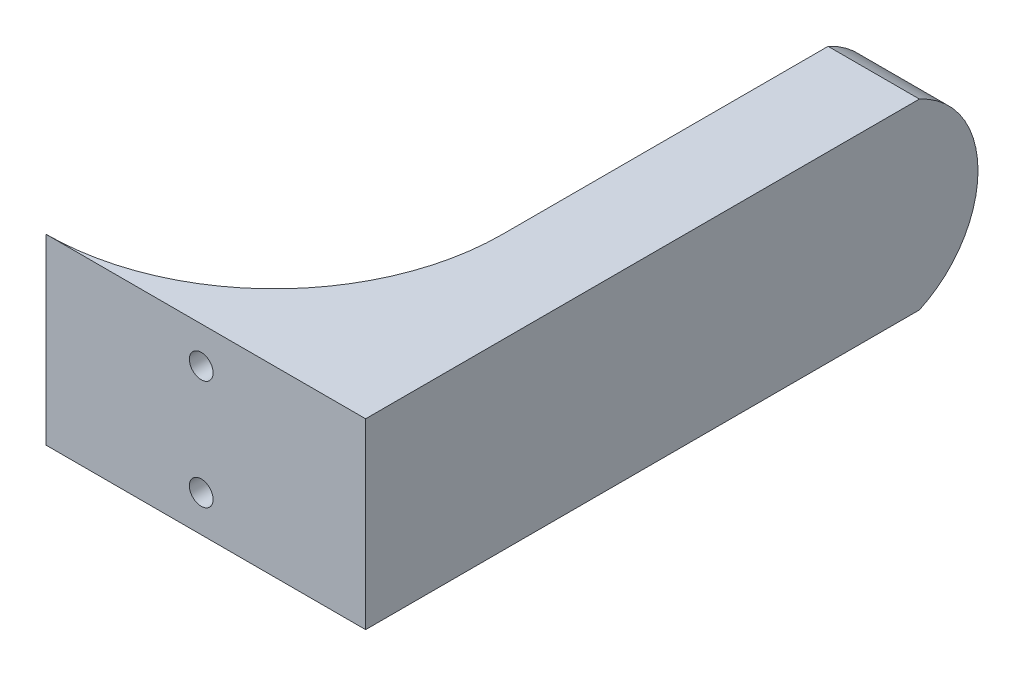
ISO-10303-21;
HEADER;
FILE_DESCRIPTION(('STEP AP214'),'2;1');
FILE_NAME('part.step','',(''),(''),'','','');
FILE_SCHEMA(('AUTOMOTIVE_DESIGN { 1 0 10303 214 1 1 1 1 }'));
ENDSEC;
DATA;
#1=APPLICATION_CONTEXT('core data for automotive mechanical design processes');
#2=APPLICATION_PROTOCOL_DEFINITION('international standard','automotive_design',2000,#1);
#3=PRODUCT_CONTEXT('',#1,'mechanical');
#4=PRODUCT('Part','Part','',(#3));
#5=PRODUCT_RELATED_PRODUCT_CATEGORY('part','',(#4));
#6=PRODUCT_DEFINITION_FORMATION('','',#4);
#7=PRODUCT_DEFINITION_CONTEXT('part definition',#1,'design');
#8=PRODUCT_DEFINITION('design','',#6,#7);
#9=PRODUCT_DEFINITION_SHAPE('','',#8);
#10=(LENGTH_UNIT() NAMED_UNIT(*) SI_UNIT(.MILLI.,.METRE.));
#11=(NAMED_UNIT(*) PLANE_ANGLE_UNIT() SI_UNIT($,.RADIAN.));
#12=(NAMED_UNIT(*) SI_UNIT($,.STERADIAN.) SOLID_ANGLE_UNIT());
#13=UNCERTAINTY_MEASURE_WITH_UNIT(LENGTH_MEASURE(1.E-05),#10,'distance_accuracy_value','');
#14=(GEOMETRIC_REPRESENTATION_CONTEXT(3) GLOBAL_UNCERTAINTY_ASSIGNED_CONTEXT((#13)) GLOBAL_UNIT_ASSIGNED_CONTEXT((#10,
#11,#12)) REPRESENTATION_CONTEXT('',''));
#15=CARTESIAN_POINT('',(0.,0.,0.));
#16=DIRECTION('',(0.,0.,1.));
#17=DIRECTION('',(1.,0.,0.));
#18=AXIS2_PLACEMENT_3D('',#15,#16,#17);
#19=CARTESIAN_POINT('',(89.7902216057907,2.2225,6.2762225952467));
#20=DIRECTION('',(0.86602540378444,0.499999999999998,0.));
#21=DIRECTION('',(-0.499999999999998,0.86602540378444,0.));
#22=AXIS2_PLACEMENT_3D('',#19,#20,#21);
#23=PLANE('',#22);
#24=DIRECTION('',(0.,0.,1.));
#25=VECTOR('',#24,1.);
#26=CARTESIAN_POINT('',(88.1404432115813,5.08000000000001,6.2762225952467));
#27=LINE('',#26,#25);
#28=CARTESIAN_POINT('',(88.1404432115813,5.08000000000001,85.6423060078275));
#29=VERTEX_POINT('',#28);
#30=CARTESIAN_POINT('',(88.1404432115813,5.08000000000001,88.9));
#31=VERTEX_POINT('',#30);
#32=EDGE_CURVE('E161',#29,#31,#27,.T.);
#33=ORIENTED_EDGE('',*,*,#32,.T.);
#34=DIRECTION('',(0.499999999999998,-0.86602540378444,0.));
#35=VECTOR('',#34,1.);
#36=CARTESIAN_POINT('',(89.7902216057907,2.2225,88.9));
#37=LINE('',#36,#35);
#38=CARTESIAN_POINT('',(89.7902216057907,2.2225,88.9));
#39=VERTEX_POINT('',#38);
#40=EDGE_CURVE('E150',#31,#39,#37,.T.);
#41=ORIENTED_EDGE('',*,*,#40,.T.);
#42=DIRECTION('',(0.,0.,1.));
#43=VECTOR('',#42,1.);
#44=CARTESIAN_POINT('',(89.7902216057907,2.2225,6.2762225952467));
#45=LINE('',#44,#43);
#46=CARTESIAN_POINT('',(89.7902216057907,2.2225,84.3972876356746));
#47=VERTEX_POINT('',#46);
#48=EDGE_CURVE('E158',#47,#39,#45,.T.);
#49=ORIENTED_EDGE('',*,*,#48,.F.);
#50=CARTESIAN_POINT('',(69.85,36.7599769354123,59.69));
#51=DIRECTION('',(0.86602540378444,0.499999999999998,0.));
#52=DIRECTION('',(0.499999999999998,-0.86602540378444,0.));
#53=AXIS2_PLACEMENT_3D('',#50,#51,#52);
#54=ELLIPSE('',#53,63.5000000000002,31.75);
#55=EDGE_CURVE('E244',#47,#29,#54,.F.);
#56=ORIENTED_EDGE('',*,*,#55,.T.);
#57=EDGE_LOOP('',(#33,#41,#49,#56));
#58=FACE_BOUND('',#57,.T.);
#59=ADVANCED_FACE('F33',(#58),#23,.T.);
#60=CARTESIAN_POINT('',(88.1404432115813,5.08000000000001,6.2762225952467));
#61=DIRECTION('',(0.86602540378444,-0.499999999999998,0.));
#62=DIRECTION('',(0.499999999999998,0.86602540378444,0.));
#63=AXIS2_PLACEMENT_3D('',#60,#61,#62);
#64=PLANE('',#63);
#65=DIRECTION('',(0.,0.,1.));
#66=VECTOR('',#65,1.);
#67=CARTESIAN_POINT('',(89.7902216057907,7.93749999999999,6.2762225952467));
#68=LINE('',#67,#66);
#69=CARTESIAN_POINT('',(89.7902216057907,7.93749999999999,84.3972876356746));
#70=VERTEX_POINT('',#69);
#71=CARTESIAN_POINT('',(89.7902216057907,7.93749999999999,88.9));
#72=VERTEX_POINT('',#71);
#73=EDGE_CURVE('E183',#70,#72,#68,.T.);
#74=ORIENTED_EDGE('',*,*,#73,.T.);
#75=DIRECTION('',(-0.499999999999998,-0.86602540378444,0.));
#76=VECTOR('',#75,1.);
#77=CARTESIAN_POINT('',(88.1404432115813,5.08000000000001,88.9));
#78=LINE('',#77,#76);
#79=EDGE_CURVE('E162',#72,#31,#78,.T.);
#80=ORIENTED_EDGE('',*,*,#79,.T.);
#81=ORIENTED_EDGE('',*,*,#32,.F.);
#82=CARTESIAN_POINT('',(69.85,-26.5999769354123,59.69));
#83=DIRECTION('',(0.86602540378444,-0.499999999999998,0.));
#84=DIRECTION('',(-0.499999999999998,-0.86602540378444,0.));
#85=AXIS2_PLACEMENT_3D('',#82,#83,#84);
#86=ELLIPSE('',#85,63.5000000000002,31.75);
#87=EDGE_CURVE('E242',#29,#70,#86,.F.);
#88=ORIENTED_EDGE('',*,*,#87,.T.);
#89=EDGE_LOOP('',(#74,#80,#81,#88));
#90=FACE_BOUND('',#89,.T.);
#91=ADVANCED_FACE('F378',(#90),#64,.T.);
#92=CARTESIAN_POINT('',(89.7902216057907,7.93749999999999,6.2762225952467));
#93=DIRECTION('',(0.,-1.,0.));
#94=DIRECTION('',(0.,0.,-1.));
#95=AXIS2_PLACEMENT_3D('',#92,#93,#94);
#96=PLANE('',#95);
#97=DIRECTION('',(0.,0.,1.));
#98=VECTOR('',#97,1.);
#99=CARTESIAN_POINT('',(93.0897783942094,7.93749999999999,6.2762225952467));
#100=LINE('',#99,#98);
#101=CARTESIAN_POINT('',(93.0897783942094,7.93749999999999,81.3227344593336));
#102=VERTEX_POINT('',#101);
#103=CARTESIAN_POINT('',(93.0897783942094,7.93749999999999,88.9));
#104=VERTEX_POINT('',#103);
#105=EDGE_CURVE('E180',#102,#104,#100,.T.);
#106=ORIENTED_EDGE('',*,*,#105,.T.);
#107=DIRECTION('',(-1.,0.,0.));
#108=VECTOR('',#107,1.);
#109=CARTESIAN_POINT('',(89.7902216057907,7.93749999999999,88.9));
#110=LINE('',#109,#108);
#111=EDGE_CURVE('E311',#104,#72,#110,.T.);
#112=ORIENTED_EDGE('',*,*,#111,.T.);
#113=ORIENTED_EDGE('',*,*,#73,.F.);
#114=CARTESIAN_POINT('',(69.85,7.93749999999999,59.69));
#115=DIRECTION('',(0.,-1.,0.));
#116=DIRECTION('',(0.,0.,-1.));
#117=AXIS2_PLACEMENT_3D('',#114,#115,#116);
#118=CIRCLE('',#117,31.75);
#119=EDGE_CURVE('E240',#70,#102,#118,.F.);
#120=ORIENTED_EDGE('',*,*,#119,.T.);
#121=EDGE_LOOP('',(#106,#112,#113,#120));
#122=FACE_BOUND('',#121,.T.);
#123=ADVANCED_FACE('F383',(#122),#96,.T.);
#124=CARTESIAN_POINT('',(93.0897783942094,7.93749999999999,6.2762225952467));
#125=DIRECTION('',(-0.866025403784439,-0.499999999999999,0.));
#126=DIRECTION('',(0.499999999999999,-0.866025403784439,0.));
#127=AXIS2_PLACEMENT_3D('',#124,#125,#126);
#128=PLANE('',#127);
#129=DIRECTION('',(0.,0.,1.));
#130=VECTOR('',#129,1.);
#131=CARTESIAN_POINT('',(94.7395567884187,5.07999999999999,6.2762225952467));
#132=LINE('',#131,#130);
#133=CARTESIAN_POINT('',(94.7395567884187,5.07999999999999,79.4022414472855));
#134=VERTEX_POINT('',#133);
#135=CARTESIAN_POINT('',(94.7395567884187,5.07999999999999,88.9));
#136=VERTEX_POINT('',#135);
#137=EDGE_CURVE('E170',#134,#136,#132,.T.);
#138=ORIENTED_EDGE('',*,*,#137,.T.);
#139=DIRECTION('',(-0.499999999999999,0.866025403784439,0.));
#140=VECTOR('',#139,1.);
#141=CARTESIAN_POINT('',(93.0897783942094,7.93749999999999,88.9));
#142=LINE('',#141,#140);
#143=EDGE_CURVE('E314',#136,#104,#142,.T.);
#144=ORIENTED_EDGE('',*,*,#143,.T.);
#145=ORIENTED_EDGE('',*,*,#105,.F.);
#146=CARTESIAN_POINT('',(69.85,48.1899769354122,59.69));
#147=DIRECTION('',(-0.866025403784439,-0.499999999999999,0.));
#148=DIRECTION('',(0.499999999999999,-0.866025403784439,0.));
#149=AXIS2_PLACEMENT_3D('',#146,#147,#148);
#150=ELLIPSE('',#149,63.5000000000001,31.75);
#151=EDGE_CURVE('E238',#102,#134,#150,.F.);
#152=ORIENTED_EDGE('',*,*,#151,.T.);
#153=EDGE_LOOP('',(#138,#144,#145,#152));
#154=FACE_BOUND('',#153,.T.);
#155=ADVANCED_FACE('F486',(#154),#128,.T.);
#156=CARTESIAN_POINT('',(94.7395567884187,5.07999999999999,6.2762225952467));
#157=DIRECTION('',(-0.86602540378444,0.499999999999997,0.));
#158=DIRECTION('',(-0.499999999999997,-0.86602540378444,0.));
#159=AXIS2_PLACEMENT_3D('',#156,#157,#158);
#160=PLANE('',#159);
#161=DIRECTION('',(0.,0.,1.));
#162=VECTOR('',#161,1.);
#163=CARTESIAN_POINT('',(93.0897783942094,2.2225,6.2762225952467));
#164=LINE('',#163,#162);
#165=CARTESIAN_POINT('',(93.0897783942094,2.2225,81.3227344593336));
#166=VERTEX_POINT('',#165);
#167=CARTESIAN_POINT('',(93.0897783942094,2.2225,88.9));
#168=VERTEX_POINT('',#167);
#169=EDGE_CURVE('E167',#166,#168,#164,.T.);
#170=ORIENTED_EDGE('',*,*,#169,.T.);
#171=DIRECTION('',(0.499999999999997,0.86602540378444,0.));
#172=VECTOR('',#171,1.);
#173=CARTESIAN_POINT('',(94.7395567884187,5.07999999999999,88.9));
#174=LINE('',#173,#172);
#175=EDGE_CURVE('E48',#168,#136,#174,.T.);
#176=ORIENTED_EDGE('',*,*,#175,.T.);
#177=ORIENTED_EDGE('',*,*,#137,.F.);
#178=CARTESIAN_POINT('',(69.85,-38.0299769354124,59.69));
#179=DIRECTION('',(-0.86602540378444,0.499999999999997,0.));
#180=DIRECTION('',(-0.499999999999997,-0.86602540378444,0.));
#181=AXIS2_PLACEMENT_3D('',#178,#179,#180);
#182=ELLIPSE('',#181,63.5000000000003,31.75);
#183=EDGE_CURVE('E235',#134,#166,#182,.F.);
#184=ORIENTED_EDGE('',*,*,#183,.T.);
#185=EDGE_LOOP('',(#170,#176,#177,#184));
#186=FACE_BOUND('',#185,.T.);
#187=ADVANCED_FACE('F494',(#186),#160,.T.);
#188=CARTESIAN_POINT('',(93.0897783942094,2.2225,6.2762225952467));
#189=DIRECTION('',(0.,1.,0.));
#190=DIRECTION('',(0.,0.,1.));
#191=AXIS2_PLACEMENT_3D('',#188,#189,#190);
#192=PLANE('',#191);
#193=ORIENTED_EDGE('',*,*,#48,.T.);
#194=DIRECTION('',(1.,0.,0.));
#195=VECTOR('',#194,1.);
#196=CARTESIAN_POINT('',(93.0897783942094,2.2225,88.9));
#197=LINE('',#196,#195);
#198=EDGE_CURVE('E11',#39,#168,#197,.T.);
#199=ORIENTED_EDGE('',*,*,#198,.T.);
#200=ORIENTED_EDGE('',*,*,#169,.F.);
#201=CARTESIAN_POINT('',(69.85,2.2225,59.69));
#202=DIRECTION('',(0.,1.,0.));
#203=DIRECTION('',(0.,0.,1.));
#204=AXIS2_PLACEMENT_3D('',#201,#202,#203);
#205=CIRCLE('',#204,31.75);
#206=EDGE_CURVE('E166',#166,#47,#205,.F.);
#207=ORIENTED_EDGE('',*,*,#206,.T.);
#208=EDGE_LOOP('',(#193,#199,#200,#207));
#209=FACE_BOUND('',#208,.T.);
#210=ADVANCED_FACE('F164',(#209),#192,.T.);
#211=CARTESIAN_POINT('',(89.7902216057907,17.4625,6.2762225952467));
#212=DIRECTION('',(0.86602540378444,0.499999999999998,0.));
#213=DIRECTION('',(-0.499999999999998,0.86602540378444,0.));
#214=AXIS2_PLACEMENT_3D('',#211,#212,#213);
#215=PLANE('',#214);
#216=DIRECTION('',(0.,0.,1.));
#217=VECTOR('',#216,1.);
#218=CARTESIAN_POINT('',(88.1404432115813,20.32,6.2762225952467));
#219=LINE('',#218,#217);
#220=CARTESIAN_POINT('',(88.1404432115813,20.32,85.6423060078275));
#221=VERTEX_POINT('',#220);
#222=CARTESIAN_POINT('',(88.1404432115813,20.32,88.9));
#223=VERTEX_POINT('',#222);
#224=EDGE_CURVE('E175',#221,#223,#219,.T.);
#225=ORIENTED_EDGE('',*,*,#224,.T.);
#226=DIRECTION('',(0.499999999999998,-0.86602540378444,0.));
#227=VECTOR('',#226,1.);
#228=CARTESIAN_POINT('',(89.7902216057907,17.4625,88.9));
#229=LINE('',#228,#227);
#230=CARTESIAN_POINT('',(89.7902216057907,17.4625,88.9));
#231=VERTEX_POINT('',#230);
#232=EDGE_CURVE('E172',#223,#231,#229,.T.);
#233=ORIENTED_EDGE('',*,*,#232,.T.);
#234=DIRECTION('',(0.,0.,1.));
#235=VECTOR('',#234,1.);
#236=CARTESIAN_POINT('',(89.7902216057907,17.4625,6.2762225952467));
#237=LINE('',#236,#235);
#238=CARTESIAN_POINT('',(89.7902216057907,17.4625,84.3972876356746));
#239=VERTEX_POINT('',#238);
#240=EDGE_CURVE('E187',#239,#231,#237,.T.);
#241=ORIENTED_EDGE('',*,*,#240,.F.);
#242=CARTESIAN_POINT('',(69.85,51.9999769354123,59.69));
#243=DIRECTION('',(0.86602540378444,0.499999999999998,0.));
#244=DIRECTION('',(0.499999999999998,-0.86602540378444,0.));
#245=AXIS2_PLACEMENT_3D('',#242,#243,#244);
#246=ELLIPSE('',#245,63.5000000000003,31.75);
#247=EDGE_CURVE('E257',#239,#221,#246,.F.);
#248=ORIENTED_EDGE('',*,*,#247,.T.);
#249=EDGE_LOOP('',(#225,#233,#241,#248));
#250=FACE_BOUND('',#249,.T.);
#251=ADVANCED_FACE('F286',(#250),#215,.T.);
#252=CARTESIAN_POINT('',(88.1404432115813,20.32,6.2762225952467));
#253=DIRECTION('',(0.86602540378444,-0.499999999999999,0.));
#254=DIRECTION('',(0.499999999999999,0.86602540378444,0.));
#255=AXIS2_PLACEMENT_3D('',#252,#253,#254);
#256=PLANE('',#255);
#257=DIRECTION('',(0.,0.,1.));
#258=VECTOR('',#257,1.);
#259=CARTESIAN_POINT('',(89.7902216057907,23.1775,6.2762225952467));
#260=LINE('',#259,#258);
#261=CARTESIAN_POINT('',(89.7902216057907,23.1775,84.3972876356746));
#262=VERTEX_POINT('',#261);
#263=CARTESIAN_POINT('',(89.7902216057907,23.1775,88.9));
#264=VERTEX_POINT('',#263);
#265=EDGE_CURVE('E278',#262,#264,#260,.T.);
#266=ORIENTED_EDGE('',*,*,#265,.T.);
#267=DIRECTION('',(-0.499999999999999,-0.86602540378444,0.));
#268=VECTOR('',#267,1.);
#269=CARTESIAN_POINT('',(88.1404432115813,20.32,88.9));
#270=LINE('',#269,#268);
#271=EDGE_CURVE('E290',#264,#223,#270,.T.);
#272=ORIENTED_EDGE('',*,*,#271,.T.);
#273=ORIENTED_EDGE('',*,*,#224,.F.);
#274=CARTESIAN_POINT('',(69.85,-11.3599769354122,59.69));
#275=DIRECTION('',(0.86602540378444,-0.499999999999999,0.));
#276=DIRECTION('',(-0.499999999999999,-0.86602540378444,0.));
#277=AXIS2_PLACEMENT_3D('',#274,#275,#276);
#278=ELLIPSE('',#277,63.5000000000002,31.75);
#279=EDGE_CURVE('E255',#221,#262,#278,.F.);
#280=ORIENTED_EDGE('',*,*,#279,.T.);
#281=EDGE_LOOP('',(#266,#272,#273,#280));
#282=FACE_BOUND('',#281,.T.);
#283=ADVANCED_FACE('F289',(#282),#256,.T.);
#284=CARTESIAN_POINT('',(89.7902216057907,23.1775,6.2762225952467));
#285=DIRECTION('',(0.,-1.,0.));
#286=DIRECTION('',(0.,0.,-1.));
#287=AXIS2_PLACEMENT_3D('',#284,#285,#286);
#288=PLANE('',#287);
#289=DIRECTION('',(0.,0.,1.));
#290=VECTOR('',#289,1.);
#291=CARTESIAN_POINT('',(93.0897783942094,23.1775,6.2762225952467));
#292=LINE('',#291,#290);
#293=CARTESIAN_POINT('',(93.0897783942094,23.1775,81.3227344593336));
#294=VERTEX_POINT('',#293);
#295=CARTESIAN_POINT('',(93.0897783942094,23.1775,88.9));
#296=VERTEX_POINT('',#295);
#297=EDGE_CURVE('E273',#294,#296,#292,.T.);
#298=ORIENTED_EDGE('',*,*,#297,.T.);
#299=DIRECTION('',(-1.,0.,0.));
#300=VECTOR('',#299,1.);
#301=CARTESIAN_POINT('',(89.7902216057907,23.1775,88.9));
#302=LINE('',#301,#300);
#303=EDGE_CURVE('E303',#296,#264,#302,.T.);
#304=ORIENTED_EDGE('',*,*,#303,.T.);
#305=ORIENTED_EDGE('',*,*,#265,.F.);
#306=CARTESIAN_POINT('',(69.85,23.1775,59.69));
#307=DIRECTION('',(0.,-1.,0.));
#308=DIRECTION('',(0.,0.,-1.));
#309=AXIS2_PLACEMENT_3D('',#306,#307,#308);
#310=CIRCLE('',#309,31.75);
#311=EDGE_CURVE('E253',#262,#294,#310,.F.);
#312=ORIENTED_EDGE('',*,*,#311,.T.);
#313=EDGE_LOOP('',(#298,#304,#305,#312));
#314=FACE_BOUND('',#313,.T.);
#315=ADVANCED_FACE('F297',(#314),#288,.T.);
#316=CARTESIAN_POINT('',(93.0897783942094,23.1775,6.2762225952467));
#317=DIRECTION('',(-0.866025403784436,-0.500000000000005,0.));
#318=DIRECTION('',(0.500000000000005,-0.866025403784436,0.));
#319=AXIS2_PLACEMENT_3D('',#316,#317,#318);
#320=PLANE('',#319);
#321=DIRECTION('',(0.,0.,1.));
#322=VECTOR('',#321,1.);
#323=CARTESIAN_POINT('',(94.7395567884188,20.32,6.2762225952467));
#324=LINE('',#323,#322);
#325=CARTESIAN_POINT('',(94.7395567884188,20.32,79.4022414472855));
#326=VERTEX_POINT('',#325);
#327=CARTESIAN_POINT('',(94.7395567884188,20.32,88.9));
#328=VERTEX_POINT('',#327);
#329=EDGE_CURVE('E271',#326,#328,#324,.T.);
#330=ORIENTED_EDGE('',*,*,#329,.T.);
#331=DIRECTION('',(-0.500000000000005,0.866025403784436,0.));
#332=VECTOR('',#331,1.);
#333=CARTESIAN_POINT('',(93.0897783942094,23.1775,88.9));
#334=LINE('',#333,#332);
#335=EDGE_CURVE('E302',#328,#296,#334,.T.);
#336=ORIENTED_EDGE('',*,*,#335,.T.);
#337=ORIENTED_EDGE('',*,*,#297,.F.);
#338=CARTESIAN_POINT('',(69.85,63.4299769354115,59.69));
#339=DIRECTION('',(-0.866025403784436,-0.500000000000005,0.));
#340=DIRECTION('',(0.500000000000005,-0.866025403784436,0.));
#341=AXIS2_PLACEMENT_3D('',#338,#339,#340);
#342=ELLIPSE('',#341,63.4999999999993,31.75);
#343=EDGE_CURVE('E251',#294,#326,#342,.F.);
#344=ORIENTED_EDGE('',*,*,#343,.T.);
#345=EDGE_LOOP('',(#330,#336,#337,#344));
#346=FACE_BOUND('',#345,.T.);
#347=ADVANCED_FACE('F301',(#346),#320,.T.);
#348=CARTESIAN_POINT('',(94.7395567884188,20.32,6.2762225952467));
#349=DIRECTION('',(-0.866025403784436,0.500000000000004,0.));
#350=DIRECTION('',(-0.500000000000004,-0.866025403784436,0.));
#351=AXIS2_PLACEMENT_3D('',#348,#349,#350);
#352=PLANE('',#351);
#353=DIRECTION('',(0.,0.,1.));
#354=VECTOR('',#353,1.);
#355=CARTESIAN_POINT('',(93.0897783942094,17.4625,6.2762225952467));
#356=LINE('',#355,#354);
#357=CARTESIAN_POINT('',(93.0897783942094,17.4625,81.3227344593336));
#358=VERTEX_POINT('',#357);
#359=CARTESIAN_POINT('',(93.0897783942094,17.4625,88.9));
#360=VERTEX_POINT('',#359);
#361=EDGE_CURVE('E262',#358,#360,#356,.T.);
#362=ORIENTED_EDGE('',*,*,#361,.T.);
#363=DIRECTION('',(0.500000000000004,0.866025403784436,0.));
#364=VECTOR('',#363,1.);
#365=CARTESIAN_POINT('',(94.7395567884188,20.32,88.9));
#366=LINE('',#365,#364);
#367=EDGE_CURVE('E55',#360,#328,#366,.T.);
#368=ORIENTED_EDGE('',*,*,#367,.T.);
#369=ORIENTED_EDGE('',*,*,#329,.F.);
#370=CARTESIAN_POINT('',(69.85,-22.7899769354117,59.69));
#371=DIRECTION('',(-0.866025403784436,0.500000000000004,0.));
#372=DIRECTION('',(-0.500000000000004,-0.866025403784436,0.));
#373=AXIS2_PLACEMENT_3D('',#370,#371,#372);
#374=ELLIPSE('',#373,63.4999999999995,31.75);
#375=EDGE_CURVE('E248',#326,#358,#374,.F.);
#376=ORIENTED_EDGE('',*,*,#375,.T.);
#377=EDGE_LOOP('',(#362,#368,#369,#376));
#378=FACE_BOUND('',#377,.T.);
#379=ADVANCED_FACE('F266',(#378),#352,.T.);
#380=CARTESIAN_POINT('',(93.0897783942094,17.4625,6.2762225952467));
#381=DIRECTION('',(0.,1.,0.));
#382=DIRECTION('',(0.,0.,1.));
#383=AXIS2_PLACEMENT_3D('',#380,#381,#382);
#384=PLANE('',#383);
#385=ORIENTED_EDGE('',*,*,#240,.T.);
#386=DIRECTION('',(1.,0.,0.));
#387=VECTOR('',#386,1.);
#388=CARTESIAN_POINT('',(93.0897783942094,17.4625,88.9));
#389=LINE('',#388,#387);
#390=EDGE_CURVE('E41',#231,#360,#389,.T.);
#391=ORIENTED_EDGE('',*,*,#390,.T.);
#392=ORIENTED_EDGE('',*,*,#361,.F.);
#393=CARTESIAN_POINT('',(69.85,17.4625,59.69));
#394=DIRECTION('',(0.,1.,0.));
#395=DIRECTION('',(0.,0.,1.));
#396=AXIS2_PLACEMENT_3D('',#393,#394,#395);
#397=CIRCLE('',#396,31.75);
#398=EDGE_CURVE('E246',#358,#239,#397,.F.);
#399=ORIENTED_EDGE('',*,*,#398,.T.);
#400=EDGE_LOOP('',(#385,#391,#392,#399));
#401=FACE_BOUND('',#400,.T.);
#402=ADVANCED_FACE('F261',(#401),#384,.T.);
#403=CARTESIAN_POINT('',(69.85,25.4,59.69));
#404=DIRECTION('',(0.,-1.,0.));
#405=DIRECTION('',(0.,0.,-1.));
#406=AXIS2_PLACEMENT_3D('',#403,#404,#405);
#407=CYLINDRICAL_SURFACE('',#406,31.75);
#408=ORIENTED_EDGE('',*,*,#55,.F.);
#409=ORIENTED_EDGE('',*,*,#206,.F.);
#410=ORIENTED_EDGE('',*,*,#183,.F.);
#411=ORIENTED_EDGE('',*,*,#151,.F.);
#412=ORIENTED_EDGE('',*,*,#119,.F.);
#413=ORIENTED_EDGE('',*,*,#87,.F.);
#414=EDGE_LOOP('',(#408,#409,#410,#411,#412,#413));
#415=FACE_BOUND('',#414,.T.);
#416=CARTESIAN_POINT('',(69.85,0.,59.69));
#417=DIRECTION('',(0.,-1.,0.));
#418=DIRECTION('',(0.,0.,1.));
#419=AXIS2_PLACEMENT_3D('',#416,#417,#418);
#420=CIRCLE('',#419,31.75);
#421=CARTESIAN_POINT('',(101.6,0.,59.69));
#422=VERTEX_POINT('',#421);
#423=CARTESIAN_POINT('',(69.85,0.,91.44));
#424=VERTEX_POINT('',#423);
#425=EDGE_CURVE('E219',#422,#424,#420,.T.);
#426=ORIENTED_EDGE('',*,*,#425,.T.);
#427=DIRECTION('',(0.,-1.,0.));
#428=VECTOR('',#427,1.);
#429=CARTESIAN_POINT('',(69.85,25.4,91.44));
#430=LINE('',#429,#428);
#431=CARTESIAN_POINT('',(69.85,25.4,91.44));
#432=VERTEX_POINT('',#431);
#433=EDGE_CURVE('E224',#432,#424,#430,.T.);
#434=ORIENTED_EDGE('',*,*,#433,.F.);
#435=CARTESIAN_POINT('',(69.85,25.4,59.69));
#436=DIRECTION('',(0.,-1.,0.));
#437=DIRECTION('',(0.,0.,1.));
#438=AXIS2_PLACEMENT_3D('',#435,#436,#437);
#439=CIRCLE('',#438,31.75);
#440=CARTESIAN_POINT('',(101.6,25.4,59.69));
#441=VERTEX_POINT('',#440);
#442=EDGE_CURVE('E221',#441,#432,#439,.T.);
#443=ORIENTED_EDGE('',*,*,#442,.F.);
#444=DIRECTION('',(0.,-1.,0.));
#445=VECTOR('',#444,1.);
#446=CARTESIAN_POINT('',(101.6,25.4,59.69));
#447=LINE('',#446,#445);
#448=EDGE_CURVE('E206',#441,#422,#447,.T.);
#449=ORIENTED_EDGE('',*,*,#448,.T.);
#450=EDGE_LOOP('',(#426,#434,#443,#449));
#451=FACE_BOUND('',#450,.T.);
#452=ORIENTED_EDGE('',*,*,#247,.F.);
#453=ORIENTED_EDGE('',*,*,#398,.F.);
#454=ORIENTED_EDGE('',*,*,#375,.F.);
#455=ORIENTED_EDGE('',*,*,#343,.F.);
#456=ORIENTED_EDGE('',*,*,#311,.F.);
#457=ORIENTED_EDGE('',*,*,#279,.F.);
#458=EDGE_LOOP('',(#452,#453,#454,#455,#456,#457));
#459=FACE_BOUND('',#458,.T.);
#460=ADVANCED_FACE('F293',(#415,#451,#459),#407,.F.);
#461=CARTESIAN_POINT('',(31.75,0.,59.69));
#462=DIRECTION('',(0.,1.,0.));
#463=DIRECTION('',(0.,0.,1.));
#464=AXIS2_PLACEMENT_3D('',#461,#462,#463);
#465=PLANE('',#464);
#466=DIRECTION('',(0.,0.,1.));
#467=VECTOR('',#466,1.);
#468=CARTESIAN_POINT('',(101.6,0.,59.69));
#469=LINE('',#468,#467);
#470=CARTESIAN_POINT('',(101.6,0.,14.4263514626528));
#471=VERTEX_POINT('',#470);
#472=EDGE_CURVE('E227',#471,#422,#469,.T.);
#473=ORIENTED_EDGE('',*,*,#472,.F.);
#474=DIRECTION('',(-1.,0.,0.));
#475=VECTOR('',#474,1.);
#476=CARTESIAN_POINT('',(114.3,0.,14.4263514626528));
#477=LINE('',#476,#475);
#478=CARTESIAN_POINT('',(114.3,0.,14.4263514626528));
#479=VERTEX_POINT('',#478);
#480=EDGE_CURVE('E192',#479,#471,#477,.T.);
#481=ORIENTED_EDGE('',*,*,#480,.F.);
#482=DIRECTION('',(0.,0.,-1.));
#483=VECTOR('',#482,1.);
#484=CARTESIAN_POINT('',(114.3,0.,0.));
#485=LINE('',#484,#483);
#486=CARTESIAN_POINT('',(114.3,0.,91.44));
#487=VERTEX_POINT('',#486);
#488=EDGE_CURVE('E212',#487,#479,#485,.T.);
#489=ORIENTED_EDGE('',*,*,#488,.F.);
#490=DIRECTION('',(1.,0.,0.));
#491=VECTOR('',#490,1.);
#492=CARTESIAN_POINT('',(-7.62,0.,91.44));
#493=LINE('',#492,#491);
#494=EDGE_CURVE('E204',#424,#487,#493,.T.);
#495=ORIENTED_EDGE('',*,*,#494,.F.);
#496=ORIENTED_EDGE('',*,*,#425,.F.);
#497=EDGE_LOOP('',(#473,#481,#489,#495,#496));
#498=FACE_BOUND('',#497,.T.);
#499=ADVANCED_FACE('F361',(#498),#465,.F.);
#500=CARTESIAN_POINT('',(31.75,25.4,59.69));
#501=DIRECTION('',(0.,1.,0.));
#502=DIRECTION('',(0.,0.,1.));
#503=AXIS2_PLACEMENT_3D('',#500,#501,#502);
#504=PLANE('',#503);
#505=DIRECTION('',(-1.,0.,0.));
#506=VECTOR('',#505,1.);
#507=CARTESIAN_POINT('',(114.3,25.4,14.4263514626528));
#508=LINE('',#507,#506);
#509=CARTESIAN_POINT('',(114.3,25.4,14.4263514626528));
#510=VERTEX_POINT('',#509);
#511=CARTESIAN_POINT('',(101.6,25.4,14.4263514626528));
#512=VERTEX_POINT('',#511);
#513=EDGE_CURVE('E191',#510,#512,#508,.T.);
#514=ORIENTED_EDGE('',*,*,#513,.T.);
#515=DIRECTION('',(0.,0.,1.));
#516=VECTOR('',#515,1.);
#517=CARTESIAN_POINT('',(101.6,25.4,59.69));
#518=LINE('',#517,#516);
#519=EDGE_CURVE('E218',#512,#441,#518,.T.);
#520=ORIENTED_EDGE('',*,*,#519,.T.);
#521=ORIENTED_EDGE('',*,*,#442,.T.);
#522=DIRECTION('',(-1.,0.,0.));
#523=VECTOR('',#522,1.);
#524=CARTESIAN_POINT('',(-7.62,25.4,91.44));
#525=LINE('',#524,#523);
#526=CARTESIAN_POINT('',(114.3,25.4,91.44));
#527=VERTEX_POINT('',#526);
#528=EDGE_CURVE('E203',#527,#432,#525,.T.);
#529=ORIENTED_EDGE('',*,*,#528,.F.);
#530=DIRECTION('',(0.,0.,-1.));
#531=VECTOR('',#530,1.);
#532=CARTESIAN_POINT('',(114.3,25.4,0.));
#533=LINE('',#532,#531);
#534=EDGE_CURVE('E215',#527,#510,#533,.T.);
#535=ORIENTED_EDGE('',*,*,#534,.T.);
#536=EDGE_LOOP('',(#514,#520,#521,#529,#535));
#537=FACE_BOUND('',#536,.T.);
#538=ADVANCED_FACE('F354',(#537),#504,.T.);
#539=CARTESIAN_POINT('',(114.3,25.4,0.));
#540=DIRECTION('',(-1.,0.,0.));
#541=DIRECTION('',(0.,0.,1.));
#542=AXIS2_PLACEMENT_3D('',#539,#540,#541);
#543=PLANE('',#542);
#544=ORIENTED_EDGE('',*,*,#534,.F.);
#545=DIRECTION('',(0.,1.,0.));
#546=VECTOR('',#545,1.);
#547=CARTESIAN_POINT('',(114.3,-12.7,91.44));
#548=LINE('',#547,#546);
#549=EDGE_CURVE('E168',#487,#527,#548,.T.);
#550=ORIENTED_EDGE('',*,*,#549,.F.);
#551=ORIENTED_EDGE('',*,*,#488,.T.);
#552=CARTESIAN_POINT('',(114.3,12.7,20.2462225952467));
#553=DIRECTION('',(1.,0.,0.));
#554=DIRECTION('',(0.,0.,1.));
#555=AXIS2_PLACEMENT_3D('',#552,#553,#554);
#556=CIRCLE('',#555,13.97);
#557=EDGE_CURVE('E188',#479,#510,#556,.T.);
#558=ORIENTED_EDGE('',*,*,#557,.T.);
#559=EDGE_LOOP('',(#544,#550,#551,#558));
#560=FACE_BOUND('',#559,.T.);
#561=ADVANCED_FACE('F35',(#560),#543,.F.);
#562=CARTESIAN_POINT('',(101.6,25.4,59.69));
#563=DIRECTION('',(1.,0.,0.));
#564=DIRECTION('',(0.,0.,-1.));
#565=AXIS2_PLACEMENT_3D('',#562,#563,#564);
#566=PLANE('',#565);
#567=CARTESIAN_POINT('',(101.6,12.7,30.48));
#568=DIRECTION('',(-1.,0.,0.));
#569=DIRECTION('',(0.,0.,1.));
#570=AXIS2_PLACEMENT_3D('',#567,#568,#569);
#571=CIRCLE('',#570,3.30199999999999);
#572=CARTESIAN_POINT('',(101.6,12.7,33.782));
#573=VERTEX_POINT('',#572);
#574=EDGE_CURVE('E208',#573,#573,#571,.T.);
#575=ORIENTED_EDGE('',*,*,#574,.F.);
#576=EDGE_LOOP('',(#575));
#577=FACE_BOUND('',#576,.T.);
#578=ORIENTED_EDGE('',*,*,#519,.F.);
#579=CARTESIAN_POINT('',(101.6,12.7,20.2462225952467));
#580=DIRECTION('',(1.,0.,0.));
#581=DIRECTION('',(0.,0.,-1.));
#582=AXIS2_PLACEMENT_3D('',#579,#580,#581);
#583=CIRCLE('',#582,13.97);
#584=EDGE_CURVE('E194',#512,#471,#583,.F.);
#585=ORIENTED_EDGE('',*,*,#584,.T.);
#586=ORIENTED_EDGE('',*,*,#472,.T.);
#587=ORIENTED_EDGE('',*,*,#448,.F.);
#588=EDGE_LOOP('',(#578,#585,#586,#587));
#589=FACE_BOUND('',#588,.T.);
#590=ADVANCED_FACE('F366',(#577,#589),#566,.F.);
#591=CARTESIAN_POINT('',(109.22,12.7,30.48));
#592=DIRECTION('',(-1.,0.,0.));
#593=DIRECTION('',(0.,0.,1.));
#594=AXIS2_PLACEMENT_3D('',#591,#592,#593);
#595=CYLINDRICAL_SURFACE('',#594,3.30199999999999);
#596=CARTESIAN_POINT('',(109.22,12.7,30.48));
#597=DIRECTION('',(-1.,0.,0.));
#598=DIRECTION('',(0.,0.,1.));
#599=AXIS2_PLACEMENT_3D('',#596,#597,#598);
#600=CIRCLE('',#599,3.30199999999999);
#601=CARTESIAN_POINT('',(109.22,12.7,33.782));
#602=VERTEX_POINT('',#601);
#603=EDGE_CURVE('E209',#602,#602,#600,.T.);
#604=ORIENTED_EDGE('',*,*,#603,.F.);
#605=EDGE_LOOP('',(#604));
#606=FACE_BOUND('',#605,.T.);
#607=ORIENTED_EDGE('',*,*,#574,.T.);
#608=EDGE_LOOP('',(#607));
#609=FACE_BOUND('',#608,.T.);
#610=ADVANCED_FACE('F393',(#606,#609),#595,.F.);
#611=CARTESIAN_POINT('',(109.22,12.7,30.48));
#612=DIRECTION('',(-1.,0.,0.));
#613=DIRECTION('',(0.,0.,1.));
#614=AXIS2_PLACEMENT_3D('',#611,#612,#613);
#615=PLANE('',#614);
#616=ORIENTED_EDGE('',*,*,#603,.T.);
#617=EDGE_LOOP('',(#616));
#618=FACE_BOUND('',#617,.T.);
#619=ADVANCED_FACE('F390',(#618),#615,.T.);
#620=CARTESIAN_POINT('',(114.3,12.7,20.2462225952467));
#621=DIRECTION('',(-1.,0.,0.));
#622=DIRECTION('',(0.,0.,1.));
#623=AXIS2_PLACEMENT_3D('',#620,#621,#622);
#624=CYLINDRICAL_SURFACE('',#623,13.97);
#625=ORIENTED_EDGE('',*,*,#513,.F.);
#626=ORIENTED_EDGE('',*,*,#557,.F.);
#627=ORIENTED_EDGE('',*,*,#480,.T.);
#628=ORIENTED_EDGE('',*,*,#584,.F.);
#629=EDGE_LOOP('',(#625,#626,#627,#628));
#630=FACE_BOUND('',#629,.T.);
#631=ADVANCED_FACE('F343',(#630),#624,.T.);
#632=CARTESIAN_POINT('',(114.3,-12.7,91.44));
#633=DIRECTION('',(0.,0.,-1.));
#634=DIRECTION('',(-1.,0.,0.));
#635=AXIS2_PLACEMENT_3D('',#632,#633,#634);
#636=PLANE('',#635);
#637=CARTESIAN_POINT('',(91.44,20.32,91.44));
#638=DIRECTION('',(0.,0.,1.));
#639=DIRECTION('',(1.,0.,0.));
#640=AXIS2_PLACEMENT_3D('',#637,#638,#639);
#641=CIRCLE('',#640,1.65100000000001);
#642=CARTESIAN_POINT('',(93.091,20.32,91.44));
#643=VERTEX_POINT('',#642);
#644=EDGE_CURVE('E325',#643,#643,#641,.T.);
#645=ORIENTED_EDGE('',*,*,#644,.F.);
#646=EDGE_LOOP('',(#645));
#647=FACE_BOUND('',#646,.T.);
#648=CARTESIAN_POINT('',(91.44,5.07999999999999,91.44));
#649=DIRECTION('',(0.,0.,1.));
#650=DIRECTION('',(1.,0.,0.));
#651=AXIS2_PLACEMENT_3D('',#648,#649,#650);
#652=CIRCLE('',#651,1.65100000000001);
#653=CARTESIAN_POINT('',(93.091,5.07999999999999,91.44));
#654=VERTEX_POINT('',#653);
#655=EDGE_CURVE('E319',#654,#654,#652,.T.);
#656=ORIENTED_EDGE('',*,*,#655,.F.);
#657=EDGE_LOOP('',(#656));
#658=FACE_BOUND('',#657,.T.);
#659=ORIENTED_EDGE('',*,*,#549,.T.);
#660=ORIENTED_EDGE('',*,*,#528,.T.);
#661=ORIENTED_EDGE('',*,*,#433,.T.);
#662=ORIENTED_EDGE('',*,*,#494,.T.);
#663=EDGE_LOOP('',(#659,#660,#661,#662));
#664=FACE_BOUND('',#663,.T.);
#665=ADVANCED_FACE('F340',(#647,#658,#664),#636,.F.);
#666=CARTESIAN_POINT('',(91.2267180375355,20.5218891173832,88.9));
#667=DIRECTION('',(0.,0.,1.));
#668=DIRECTION('',(1.,0.,0.));
#669=AXIS2_PLACEMENT_3D('',#666,#667,#668);
#670=PLANE('',#669);
#671=CARTESIAN_POINT('',(91.44,20.32,88.9));
#672=DIRECTION('',(0.,0.,1.));
#673=DIRECTION('',(1.,0.,0.));
#674=AXIS2_PLACEMENT_3D('',#671,#672,#673);
#675=CIRCLE('',#674,1.65100000000001);
#676=CARTESIAN_POINT('',(93.091,20.32,88.9));
#677=VERTEX_POINT('',#676);
#678=EDGE_CURVE('E318',#677,#677,#675,.T.);
#679=ORIENTED_EDGE('',*,*,#678,.T.);
#680=EDGE_LOOP('',(#679));
#681=FACE_BOUND('',#680,.T.);
#682=ORIENTED_EDGE('',*,*,#232,.F.);
#683=ORIENTED_EDGE('',*,*,#271,.F.);
#684=ORIENTED_EDGE('',*,*,#303,.F.);
#685=ORIENTED_EDGE('',*,*,#335,.F.);
#686=ORIENTED_EDGE('',*,*,#367,.F.);
#687=ORIENTED_EDGE('',*,*,#390,.F.);
#688=EDGE_LOOP('',(#682,#683,#684,#685,#686,#687));
#689=FACE_BOUND('',#688,.T.);
#690=ADVANCED_FACE('F331',(#681,#689),#670,.F.);
#691=CARTESIAN_POINT('',(91.7577377363643,5.01611391158235,88.9));
#692=DIRECTION('',(0.,0.,1.));
#693=DIRECTION('',(1.,0.,0.));
#694=AXIS2_PLACEMENT_3D('',#691,#692,#693);
#695=PLANE('',#694);
#696=CARTESIAN_POINT('',(91.44,5.07999999999999,88.9));
#697=DIRECTION('',(0.,0.,1.));
#698=DIRECTION('',(1.,0.,0.));
#699=AXIS2_PLACEMENT_3D('',#696,#697,#698);
#700=CIRCLE('',#699,1.65100000000001);
#701=CARTESIAN_POINT('',(93.091,5.07999999999999,88.9));
#702=VERTEX_POINT('',#701);
#703=EDGE_CURVE('E322',#702,#702,#700,.T.);
#704=ORIENTED_EDGE('',*,*,#703,.T.);
#705=EDGE_LOOP('',(#704));
#706=FACE_BOUND('',#705,.T.);
#707=ORIENTED_EDGE('',*,*,#40,.F.);
#708=ORIENTED_EDGE('',*,*,#79,.F.);
#709=ORIENTED_EDGE('',*,*,#111,.F.);
#710=ORIENTED_EDGE('',*,*,#143,.F.);
#711=ORIENTED_EDGE('',*,*,#175,.F.);
#712=ORIENTED_EDGE('',*,*,#198,.F.);
#713=EDGE_LOOP('',(#707,#708,#709,#710,#711,#712));
#714=FACE_BOUND('',#713,.T.);
#715=ADVANCED_FACE('F149',(#706,#714),#695,.F.);
#716=CARTESIAN_POINT('',(91.44,5.07999999999999,88.9));
#717=DIRECTION('',(0.,0.,1.));
#718=DIRECTION('',(1.,0.,0.));
#719=AXIS2_PLACEMENT_3D('',#716,#717,#718);
#720=CYLINDRICAL_SURFACE('',#719,1.65100000000001);
#721=ORIENTED_EDGE('',*,*,#703,.F.);
#722=EDGE_LOOP('',(#721));
#723=FACE_BOUND('',#722,.T.);
#724=ORIENTED_EDGE('',*,*,#655,.T.);
#725=EDGE_LOOP('',(#724));
#726=FACE_BOUND('',#725,.T.);
#727=ADVANCED_FACE('F336',(#723,#726),#720,.F.);
#728=CARTESIAN_POINT('',(91.44,20.32,88.9));
#729=DIRECTION('',(0.,0.,1.));
#730=DIRECTION('',(1.,0.,0.));
#731=AXIS2_PLACEMENT_3D('',#728,#729,#730);
#732=CYLINDRICAL_SURFACE('',#731,1.65100000000001);
#733=ORIENTED_EDGE('',*,*,#678,.F.);
#734=EDGE_LOOP('',(#733));
#735=FACE_BOUND('',#734,.T.);
#736=ORIENTED_EDGE('',*,*,#644,.T.);
#737=EDGE_LOOP('',(#736));
#738=FACE_BOUND('',#737,.T.);
#739=ADVANCED_FACE('F333',(#735,#738),#732,.F.);
#740=CLOSED_SHELL('',(#59,#91,#123,#155,#187,#210,#251,#283,#315,#347,#379,#402,#460,#499,#538,
#561,#590,#610,#619,#631,#665,#690,#715,#727,#739));
#741=MANIFOLD_SOLID_BREP('B2',#740);
#742=ADVANCED_BREP_SHAPE_REPRESENTATION('',(#18,#741),#14);
#743=SHAPE_DEFINITION_REPRESENTATION(#9,#742);
ENDSEC;
END-ISO-10303-21;
